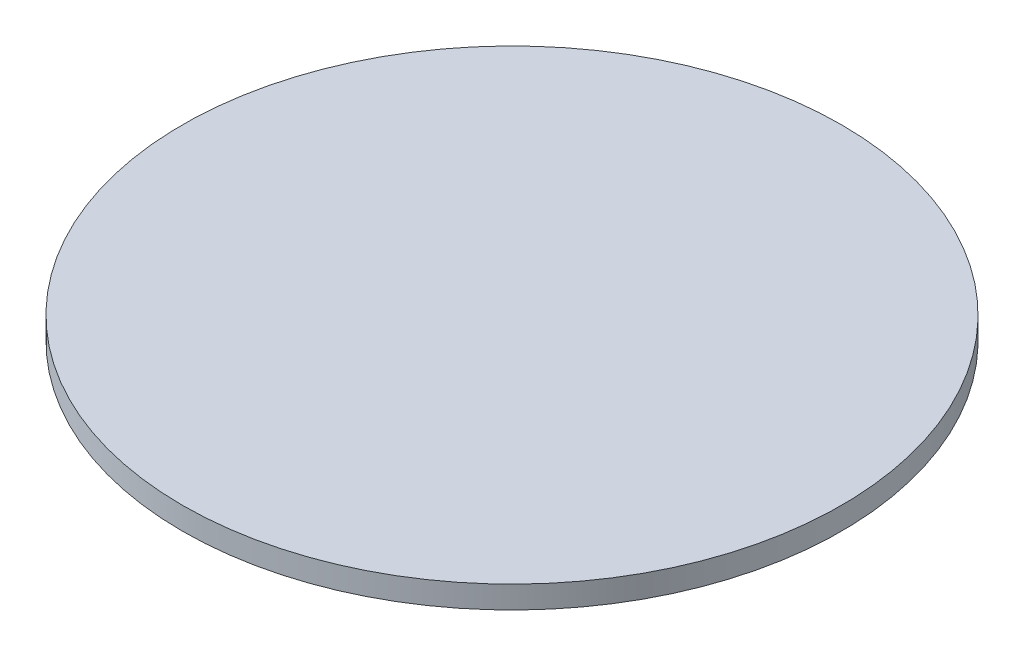
ISO-10303-21;
HEADER;
FILE_DESCRIPTION(('STEP AP214'),'2;1');
FILE_NAME('part.step','',(''),(''),'','','');
FILE_SCHEMA(('AUTOMOTIVE_DESIGN { 1 0 10303 214 1 1 1 1 }'));
ENDSEC;
DATA;
#1=APPLICATION_CONTEXT('core data for automotive mechanical design processes');
#2=APPLICATION_PROTOCOL_DEFINITION('international standard','automotive_design',2000,#1);
#3=PRODUCT_CONTEXT('',#1,'mechanical');
#4=PRODUCT('Part','Part','',(#3));
#5=PRODUCT_RELATED_PRODUCT_CATEGORY('part','',(#4));
#6=PRODUCT_DEFINITION_FORMATION('','',#4);
#7=PRODUCT_DEFINITION_CONTEXT('part definition',#1,'design');
#8=PRODUCT_DEFINITION('design','',#6,#7);
#9=PRODUCT_DEFINITION_SHAPE('','',#8);
#10=(LENGTH_UNIT() NAMED_UNIT(*) SI_UNIT(.MILLI.,.METRE.));
#11=(NAMED_UNIT(*) PLANE_ANGLE_UNIT() SI_UNIT($,.RADIAN.));
#12=(NAMED_UNIT(*) SI_UNIT($,.STERADIAN.) SOLID_ANGLE_UNIT());
#13=UNCERTAINTY_MEASURE_WITH_UNIT(LENGTH_MEASURE(1.E-05),#10,'distance_accuracy_value','');
#14=(GEOMETRIC_REPRESENTATION_CONTEXT(3) GLOBAL_UNCERTAINTY_ASSIGNED_CONTEXT((#13)) GLOBAL_UNIT_ASSIGNED_CONTEXT((#10,
#11,#12)) REPRESENTATION_CONTEXT('',''));
#15=CARTESIAN_POINT('',(0.,0.,0.));
#16=DIRECTION('',(0.,0.,1.));
#17=DIRECTION('',(1.,0.,0.));
#18=AXIS2_PLACEMENT_3D('',#15,#16,#17);
#19=CARTESIAN_POINT('',(0.,0.8,0.));
#20=DIRECTION('',(0.,-1.,0.));
#21=DIRECTION('',(0.,0.,-1.));
#22=AXIS2_PLACEMENT_3D('',#19,#20,#21);
#23=CYLINDRICAL_SURFACE('',#22,11.75);
#24=CARTESIAN_POINT('',(0.,0.8,0.));
#25=DIRECTION('',(0.,1.,0.));
#26=DIRECTION('',(0.,0.,1.));
#27=AXIS2_PLACEMENT_3D('',#24,#25,#26);
#28=CIRCLE('',#27,11.75);
#29=CARTESIAN_POINT('',(0.,0.8,11.75));
#30=VERTEX_POINT('',#29);
#31=EDGE_CURVE('E10',#30,#30,#28,.T.);
#32=ORIENTED_EDGE('',*,*,#31,.F.);
#33=EDGE_LOOP('',(#32));
#34=FACE_BOUND('',#33,.T.);
#35=CARTESIAN_POINT('',(0.,0.,0.));
#36=DIRECTION('',(0.,1.,0.));
#37=DIRECTION('',(0.,0.,1.));
#38=AXIS2_PLACEMENT_3D('',#35,#36,#37);
#39=CIRCLE('',#38,11.75);
#40=CARTESIAN_POINT('',(0.,0.,11.75));
#41=VERTEX_POINT('',#40);
#42=EDGE_CURVE('E34',#41,#41,#39,.T.);
#43=ORIENTED_EDGE('',*,*,#42,.T.);
#44=EDGE_LOOP('',(#43));
#45=FACE_BOUND('',#44,.T.);
#46=ADVANCED_FACE('F31',(#34,#45),#23,.T.);
#47=CARTESIAN_POINT('',(0.,0.8,0.));
#48=DIRECTION('',(0.,1.,0.));
#49=DIRECTION('',(0.,0.,1.));
#50=AXIS2_PLACEMENT_3D('',#47,#48,#49);
#51=PLANE('',#50);
#52=ORIENTED_EDGE('',*,*,#31,.T.);
#53=EDGE_LOOP('',(#52));
#54=FACE_BOUND('',#53,.T.);
#55=ADVANCED_FACE('F46',(#54),#51,.T.);
#56=CARTESIAN_POINT('',(0.,0.,0.));
#57=DIRECTION('',(0.,1.,0.));
#58=DIRECTION('',(0.,0.,1.));
#59=AXIS2_PLACEMENT_3D('',#56,#57,#58);
#60=PLANE('',#59);
#61=ORIENTED_EDGE('',*,*,#42,.F.);
#62=EDGE_LOOP('',(#61));
#63=FACE_BOUND('',#62,.T.);
#64=ADVANCED_FACE('F44',(#63),#60,.F.);
#65=CLOSED_SHELL('',(#46,#55,#64));
#66=MANIFOLD_SOLID_BREP('B2',#65);
#67=ADVANCED_BREP_SHAPE_REPRESENTATION('',(#18,#66),#14);
#68=SHAPE_DEFINITION_REPRESENTATION(#9,#67);
ENDSEC;
END-ISO-10303-21;
